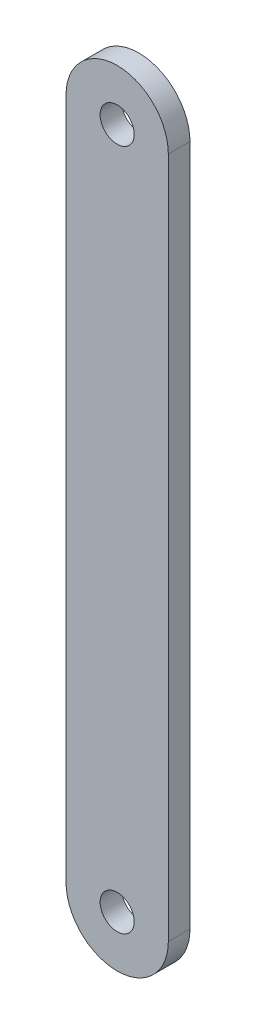
ISO-10303-21;
HEADER;
FILE_DESCRIPTION(('STEP AP214'),'2;1');
FILE_NAME('part.step','',(''),(''),'','','');
FILE_SCHEMA(('AUTOMOTIVE_DESIGN { 1 0 10303 214 1 1 1 1 }'));
ENDSEC;
DATA;
#1=APPLICATION_CONTEXT('core data for automotive mechanical design processes');
#2=APPLICATION_PROTOCOL_DEFINITION('international standard','automotive_design',2000,#1);
#3=PRODUCT_CONTEXT('',#1,'mechanical');
#4=PRODUCT('Part','Part','',(#3));
#5=PRODUCT_RELATED_PRODUCT_CATEGORY('part','',(#4));
#6=PRODUCT_DEFINITION_FORMATION('','',#4);
#7=PRODUCT_DEFINITION_CONTEXT('part definition',#1,'design');
#8=PRODUCT_DEFINITION('design','',#6,#7);
#9=PRODUCT_DEFINITION_SHAPE('','',#8);
#10=(LENGTH_UNIT() NAMED_UNIT(*) SI_UNIT(.MILLI.,.METRE.));
#11=(NAMED_UNIT(*) PLANE_ANGLE_UNIT() SI_UNIT($,.RADIAN.));
#12=(NAMED_UNIT(*) SI_UNIT($,.STERADIAN.) SOLID_ANGLE_UNIT());
#13=UNCERTAINTY_MEASURE_WITH_UNIT(LENGTH_MEASURE(1.E-05),#10,'distance_accuracy_value','');
#14=(GEOMETRIC_REPRESENTATION_CONTEXT(3) GLOBAL_UNCERTAINTY_ASSIGNED_CONTEXT((#13)) GLOBAL_UNIT_ASSIGNED_CONTEXT((#10,
#11,#12)) REPRESENTATION_CONTEXT('',''));
#15=CARTESIAN_POINT('',(0.,0.,0.));
#16=DIRECTION('',(0.,0.,1.));
#17=DIRECTION('',(1.,0.,0.));
#18=AXIS2_PLACEMENT_3D('',#15,#16,#17);
#19=CARTESIAN_POINT('',(0.,0.,6.35));
#20=DIRECTION('',(0.,0.,1.));
#21=DIRECTION('',(1.,0.,0.));
#22=AXIS2_PLACEMENT_3D('',#19,#20,#21);
#23=PLANE('',#22);
#24=CARTESIAN_POINT('',(0.,200.,6.35));
#25=DIRECTION('',(0.,0.,1.));
#26=DIRECTION('',(1.,0.,0.));
#27=AXIS2_PLACEMENT_3D('',#24,#25,#26);
#28=CIRCLE('',#27,5.);
#29=CARTESIAN_POINT('',(5.,200.,6.35));
#30=VERTEX_POINT('',#29);
#31=EDGE_CURVE('E100',#30,#30,#28,.T.);
#32=ORIENTED_EDGE('',*,*,#31,.F.);
#33=EDGE_LOOP('',(#32));
#34=FACE_BOUND('',#33,.T.);
#35=CARTESIAN_POINT('',(0.,0.,6.35));
#36=DIRECTION('',(0.,0.,1.));
#37=DIRECTION('',(1.,0.,0.));
#38=AXIS2_PLACEMENT_3D('',#35,#36,#37);
#39=CIRCLE('',#38,15.);
#40=CARTESIAN_POINT('',(-15.,0.,6.35));
#41=VERTEX_POINT('',#40);
#42=CARTESIAN_POINT('',(15.,0.,6.35));
#43=VERTEX_POINT('',#42);
#44=EDGE_CURVE('E85',#41,#43,#39,.T.);
#45=ORIENTED_EDGE('',*,*,#44,.T.);
#46=DIRECTION('',(0.,1.,0.));
#47=VECTOR('',#46,1.);
#48=CARTESIAN_POINT('',(15.,0.,6.35));
#49=LINE('',#48,#47);
#50=CARTESIAN_POINT('',(15.,200.,6.35));
#51=VERTEX_POINT('',#50);
#52=EDGE_CURVE('E80',#43,#51,#49,.T.);
#53=ORIENTED_EDGE('',*,*,#52,.T.);
#54=CARTESIAN_POINT('',(0.,200.,6.35));
#55=DIRECTION('',(0.,0.,1.));
#56=DIRECTION('',(1.,0.,0.));
#57=AXIS2_PLACEMENT_3D('',#54,#55,#56);
#58=CIRCLE('',#57,15.);
#59=CARTESIAN_POINT('',(-15.,200.,6.35));
#60=VERTEX_POINT('',#59);
#61=EDGE_CURVE('E83',#51,#60,#58,.T.);
#62=ORIENTED_EDGE('',*,*,#61,.T.);
#63=DIRECTION('',(0.,-1.,0.));
#64=VECTOR('',#63,1.);
#65=CARTESIAN_POINT('',(-15.,0.,6.35));
#66=LINE('',#65,#64);
#67=EDGE_CURVE('E50',#60,#41,#66,.T.);
#68=ORIENTED_EDGE('',*,*,#67,.T.);
#69=EDGE_LOOP('',(#45,#53,#62,#68));
#70=FACE_BOUND('',#69,.T.);
#71=CARTESIAN_POINT('',(0.,0.,6.35));
#72=DIRECTION('',(0.,0.,1.));
#73=DIRECTION('',(1.,0.,0.));
#74=AXIS2_PLACEMENT_3D('',#71,#72,#73);
#75=CIRCLE('',#74,5.);
#76=CARTESIAN_POINT('',(5.,0.,6.35));
#77=VERTEX_POINT('',#76);
#78=EDGE_CURVE('E115',#77,#77,#75,.T.);
#79=ORIENTED_EDGE('',*,*,#78,.F.);
#80=EDGE_LOOP('',(#79));
#81=FACE_BOUND('',#80,.T.);
#82=ADVANCED_FACE('F33',(#34,#70,#81),#23,.T.);
#83=CARTESIAN_POINT('',(0.,0.,0.));
#84=DIRECTION('',(0.,0.,1.));
#85=DIRECTION('',(1.,0.,0.));
#86=AXIS2_PLACEMENT_3D('',#83,#84,#85);
#87=PLANE('',#86);
#88=CARTESIAN_POINT('',(0.,0.,0.));
#89=DIRECTION('',(0.,0.,1.));
#90=DIRECTION('',(1.,0.,0.));
#91=AXIS2_PLACEMENT_3D('',#88,#89,#90);
#92=CIRCLE('',#91,15.);
#93=CARTESIAN_POINT('',(-15.,0.,0.));
#94=VERTEX_POINT('',#93);
#95=CARTESIAN_POINT('',(15.,0.,0.));
#96=VERTEX_POINT('',#95);
#97=EDGE_CURVE('E97',#94,#96,#92,.T.);
#98=ORIENTED_EDGE('',*,*,#97,.F.);
#99=DIRECTION('',(0.,-1.,0.));
#100=VECTOR('',#99,1.);
#101=CARTESIAN_POINT('',(-15.,0.,0.));
#102=LINE('',#101,#100);
#103=CARTESIAN_POINT('',(-15.,200.,0.));
#104=VERTEX_POINT('',#103);
#105=EDGE_CURVE('E73',#104,#94,#102,.T.);
#106=ORIENTED_EDGE('',*,*,#105,.F.);
#107=CARTESIAN_POINT('',(0.,200.,0.));
#108=DIRECTION('',(0.,0.,1.));
#109=DIRECTION('',(1.,0.,0.));
#110=AXIS2_PLACEMENT_3D('',#107,#108,#109);
#111=CIRCLE('',#110,15.);
#112=CARTESIAN_POINT('',(15.,200.,0.));
#113=VERTEX_POINT('',#112);
#114=EDGE_CURVE('E67',#113,#104,#111,.T.);
#115=ORIENTED_EDGE('',*,*,#114,.F.);
#116=DIRECTION('',(0.,1.,0.));
#117=VECTOR('',#116,1.);
#118=CARTESIAN_POINT('',(15.,0.,0.));
#119=LINE('',#118,#117);
#120=EDGE_CURVE('E89',#96,#113,#119,.T.);
#121=ORIENTED_EDGE('',*,*,#120,.F.);
#122=EDGE_LOOP('',(#98,#106,#115,#121));
#123=FACE_BOUND('',#122,.T.);
#124=CARTESIAN_POINT('',(0.,200.,0.));
#125=DIRECTION('',(0.,0.,1.));
#126=DIRECTION('',(1.,0.,0.));
#127=AXIS2_PLACEMENT_3D('',#124,#125,#126);
#128=CIRCLE('',#127,5.);
#129=CARTESIAN_POINT('',(5.,200.,0.));
#130=VERTEX_POINT('',#129);
#131=EDGE_CURVE('E112',#130,#130,#128,.T.);
#132=ORIENTED_EDGE('',*,*,#131,.T.);
#133=EDGE_LOOP('',(#132));
#134=FACE_BOUND('',#133,.T.);
#135=CARTESIAN_POINT('',(0.,0.,0.));
#136=DIRECTION('',(0.,0.,1.));
#137=DIRECTION('',(1.,0.,0.));
#138=AXIS2_PLACEMENT_3D('',#135,#136,#137);
#139=CIRCLE('',#138,5.);
#140=CARTESIAN_POINT('',(5.,0.,0.));
#141=VERTEX_POINT('',#140);
#142=EDGE_CURVE('E118',#141,#141,#139,.T.);
#143=ORIENTED_EDGE('',*,*,#142,.T.);
#144=EDGE_LOOP('',(#143));
#145=FACE_BOUND('',#144,.T.);
#146=ADVANCED_FACE('F108',(#123,#134,#145),#87,.F.);
#147=CARTESIAN_POINT('',(0.,0.,6.35));
#148=DIRECTION('',(0.,0.,-1.));
#149=DIRECTION('',(-1.,0.,0.));
#150=AXIS2_PLACEMENT_3D('',#147,#148,#149);
#151=CYLINDRICAL_SURFACE('',#150,15.);
#152=ORIENTED_EDGE('',*,*,#97,.T.);
#153=DIRECTION('',(0.,0.,-1.));
#154=VECTOR('',#153,1.);
#155=CARTESIAN_POINT('',(15.,0.,6.35));
#156=LINE('',#155,#154);
#157=EDGE_CURVE('E11',#43,#96,#156,.T.);
#158=ORIENTED_EDGE('',*,*,#157,.F.);
#159=ORIENTED_EDGE('',*,*,#44,.F.);
#160=DIRECTION('',(0.,0.,-1.));
#161=VECTOR('',#160,1.);
#162=CARTESIAN_POINT('',(-15.,0.,6.35));
#163=LINE('',#162,#161);
#164=EDGE_CURVE('E93',#41,#94,#163,.T.);
#165=ORIENTED_EDGE('',*,*,#164,.T.);
#166=EDGE_LOOP('',(#152,#158,#159,#165));
#167=FACE_BOUND('',#166,.T.);
#168=ADVANCED_FACE('F35',(#167),#151,.T.);
#169=CARTESIAN_POINT('',(15.,0.,6.35));
#170=DIRECTION('',(-1.,0.,0.));
#171=DIRECTION('',(0.,0.,1.));
#172=AXIS2_PLACEMENT_3D('',#169,#170,#171);
#173=PLANE('',#172);
#174=ORIENTED_EDGE('',*,*,#120,.T.);
#175=DIRECTION('',(0.,0.,-1.));
#176=VECTOR('',#175,1.);
#177=CARTESIAN_POINT('',(15.,200.,6.35));
#178=LINE('',#177,#176);
#179=EDGE_CURVE('E42',#51,#113,#178,.T.);
#180=ORIENTED_EDGE('',*,*,#179,.F.);
#181=ORIENTED_EDGE('',*,*,#52,.F.);
#182=ORIENTED_EDGE('',*,*,#157,.T.);
#183=EDGE_LOOP('',(#174,#180,#181,#182));
#184=FACE_BOUND('',#183,.T.);
#185=ADVANCED_FACE('F88',(#184),#173,.F.);
#186=CARTESIAN_POINT('',(0.,200.,6.35));
#187=DIRECTION('',(0.,0.,-1.));
#188=DIRECTION('',(-1.,0.,0.));
#189=AXIS2_PLACEMENT_3D('',#186,#187,#188);
#190=CYLINDRICAL_SURFACE('',#189,15.);
#191=ORIENTED_EDGE('',*,*,#114,.T.);
#192=DIRECTION('',(0.,0.,-1.));
#193=VECTOR('',#192,1.);
#194=CARTESIAN_POINT('',(-15.,200.,6.35));
#195=LINE('',#194,#193);
#196=EDGE_CURVE('E90',#60,#104,#195,.T.);
#197=ORIENTED_EDGE('',*,*,#196,.F.);
#198=ORIENTED_EDGE('',*,*,#61,.F.);
#199=ORIENTED_EDGE('',*,*,#179,.T.);
#200=EDGE_LOOP('',(#191,#197,#198,#199));
#201=FACE_BOUND('',#200,.T.);
#202=ADVANCED_FACE('F91',(#201),#190,.T.);
#203=CARTESIAN_POINT('',(-15.,0.,6.35));
#204=DIRECTION('',(1.,0.,0.));
#205=DIRECTION('',(0.,0.,-1.));
#206=AXIS2_PLACEMENT_3D('',#203,#204,#205);
#207=PLANE('',#206);
#208=ORIENTED_EDGE('',*,*,#105,.T.);
#209=ORIENTED_EDGE('',*,*,#164,.F.);
#210=ORIENTED_EDGE('',*,*,#67,.F.);
#211=ORIENTED_EDGE('',*,*,#196,.T.);
#212=EDGE_LOOP('',(#208,#209,#210,#211));
#213=FACE_BOUND('',#212,.T.);
#214=ADVANCED_FACE('F105',(#213),#207,.F.);
#215=CARTESIAN_POINT('',(0.,200.,6.35));
#216=DIRECTION('',(0.,0.,-1.));
#217=DIRECTION('',(-1.,0.,0.));
#218=AXIS2_PLACEMENT_3D('',#215,#216,#217);
#219=CYLINDRICAL_SURFACE('',#218,5.);
#220=ORIENTED_EDGE('',*,*,#31,.T.);
#221=EDGE_LOOP('',(#220));
#222=FACE_BOUND('',#221,.T.);
#223=ORIENTED_EDGE('',*,*,#131,.F.);
#224=EDGE_LOOP('',(#223));
#225=FACE_BOUND('',#224,.T.);
#226=ADVANCED_FACE('F135',(#222,#225),#219,.F.);
#227=CARTESIAN_POINT('',(0.,0.,6.35));
#228=DIRECTION('',(0.,0.,-1.));
#229=DIRECTION('',(-1.,0.,0.));
#230=AXIS2_PLACEMENT_3D('',#227,#228,#229);
#231=CYLINDRICAL_SURFACE('',#230,5.);
#232=ORIENTED_EDGE('',*,*,#78,.T.);
#233=EDGE_LOOP('',(#232));
#234=FACE_BOUND('',#233,.T.);
#235=ORIENTED_EDGE('',*,*,#142,.F.);
#236=EDGE_LOOP('',(#235));
#237=FACE_BOUND('',#236,.T.);
#238=ADVANCED_FACE('F124',(#234,#237),#231,.F.);
#239=CLOSED_SHELL('',(#82,#146,#168,#185,#202,#214,#226,#238));
#240=MANIFOLD_SOLID_BREP('B2',#239);
#241=ADVANCED_BREP_SHAPE_REPRESENTATION('',(#18,#240),#14);
#242=SHAPE_DEFINITION_REPRESENTATION(#9,#241);
ENDSEC;
END-ISO-10303-21;
